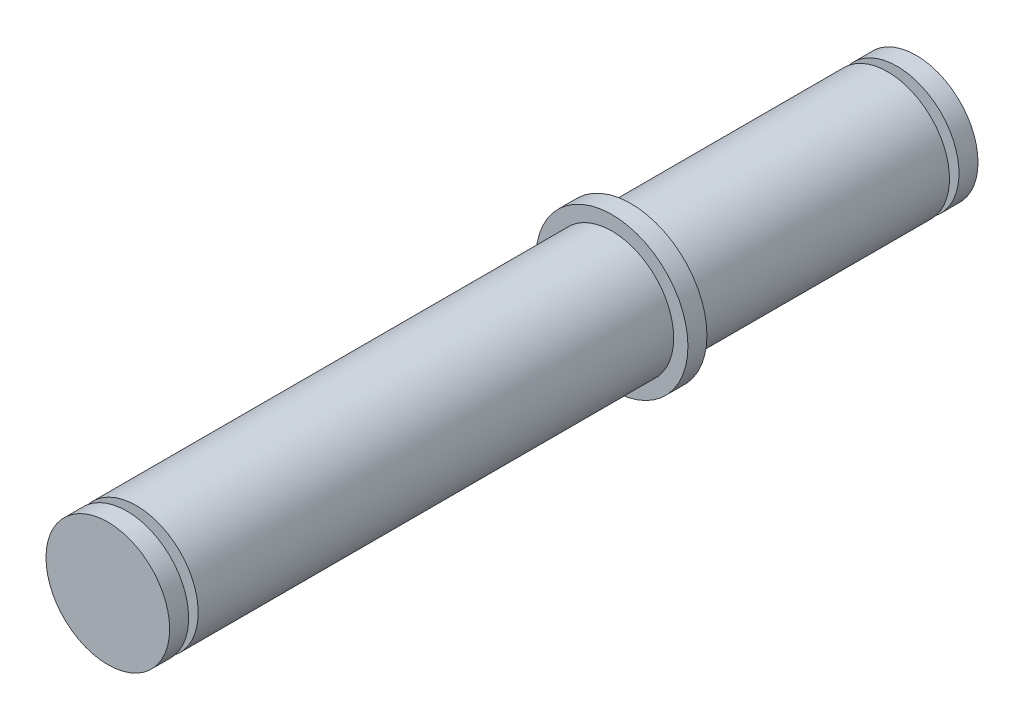
ISO-10303-21;
HEADER;
FILE_DESCRIPTION(('STEP AP214'),'2;1');
FILE_NAME('part.step','',(''),(''),'','','');
FILE_SCHEMA(('AUTOMOTIVE_DESIGN { 1 0 10303 214 1 1 1 1 }'));
ENDSEC;
DATA;
#1=APPLICATION_CONTEXT('core data for automotive mechanical design processes');
#2=APPLICATION_PROTOCOL_DEFINITION('international standard','automotive_design',2000,#1);
#3=PRODUCT_CONTEXT('',#1,'mechanical');
#4=PRODUCT('Part','Part','',(#3));
#5=PRODUCT_RELATED_PRODUCT_CATEGORY('part','',(#4));
#6=PRODUCT_DEFINITION_FORMATION('','',#4);
#7=PRODUCT_DEFINITION_CONTEXT('part definition',#1,'design');
#8=PRODUCT_DEFINITION('design','',#6,#7);
#9=PRODUCT_DEFINITION_SHAPE('','',#8);
#10=(LENGTH_UNIT() NAMED_UNIT(*) SI_UNIT(.MILLI.,.METRE.));
#11=(NAMED_UNIT(*) PLANE_ANGLE_UNIT() SI_UNIT($,.RADIAN.));
#12=(NAMED_UNIT(*) SI_UNIT($,.STERADIAN.) SOLID_ANGLE_UNIT());
#13=UNCERTAINTY_MEASURE_WITH_UNIT(LENGTH_MEASURE(1.E-05),#10,'distance_accuracy_value','');
#14=(GEOMETRIC_REPRESENTATION_CONTEXT(3) GLOBAL_UNCERTAINTY_ASSIGNED_CONTEXT((#13)) GLOBAL_UNIT_ASSIGNED_CONTEXT((#10,
#11,#12)) REPRESENTATION_CONTEXT('',''));
#15=CARTESIAN_POINT('',(0.,0.,0.));
#16=DIRECTION('',(0.,0.,1.));
#17=DIRECTION('',(1.,0.,0.));
#18=AXIS2_PLACEMENT_3D('',#15,#16,#17);
#19=CARTESIAN_POINT('',(0.,0.,42.5));
#20=DIRECTION('',(0.,0.,-1.));
#21=DIRECTION('',(-1.,0.,0.));
#22=AXIS2_PLACEMENT_3D('',#19,#20,#21);
#23=CYLINDRICAL_SURFACE('',#22,6.5);
#24=CARTESIAN_POINT('',(0.,0.,-10.5));
#25=DIRECTION('',(0.,0.,1.));
#26=DIRECTION('',(1.,0.,0.));
#27=AXIS2_PLACEMENT_3D('',#24,#25,#26);
#28=CIRCLE('',#27,6.5);
#29=CARTESIAN_POINT('',(6.5,0.,-10.5));
#30=VERTEX_POINT('',#29);
#31=EDGE_CURVE('E34',#30,#30,#28,.T.);
#32=ORIENTED_EDGE('',*,*,#31,.T.);
#33=EDGE_LOOP('',(#32));
#34=FACE_BOUND('',#33,.T.);
#35=CARTESIAN_POINT('',(0.,0.,39.5));
#36=DIRECTION('',(0.,0.,-1.));
#37=DIRECTION('',(-1.,0.,0.));
#38=AXIS2_PLACEMENT_3D('',#35,#36,#37);
#39=CIRCLE('',#38,6.5);
#40=CARTESIAN_POINT('',(-6.5,0.,39.5));
#41=VERTEX_POINT('',#40);
#42=EDGE_CURVE('E63',#41,#41,#39,.T.);
#43=ORIENTED_EDGE('',*,*,#42,.T.);
#44=EDGE_LOOP('',(#43));
#45=FACE_BOUND('',#44,.T.);
#46=ADVANCED_FACE('F30',(#34,#45),#23,.T.);
#47=CARTESIAN_POINT('',(0.,0.,-12.5));
#48=DIRECTION('',(0.,0.,1.));
#49=DIRECTION('',(1.,0.,0.));
#50=AXIS2_PLACEMENT_3D('',#47,#48,#49);
#51=CIRCLE('',#50,6.5);
#52=CARTESIAN_POINT('',(6.5,0.,-12.5));
#53=VERTEX_POINT('',#52);
#54=EDGE_CURVE('E10',#53,#53,#51,.T.);
#55=ORIENTED_EDGE('',*,*,#54,.F.);
#56=EDGE_LOOP('',(#55));
#57=FACE_BOUND('',#56,.T.);
#58=CARTESIAN_POINT('',(0.,0.,-39.5));
#59=DIRECTION('',(0.,0.,-1.));
#60=DIRECTION('',(-1.,0.,0.));
#61=AXIS2_PLACEMENT_3D('',#58,#59,#60);
#62=CIRCLE('',#61,6.5);
#63=CARTESIAN_POINT('',(-6.5,0.,-39.5));
#64=VERTEX_POINT('',#63);
#65=EDGE_CURVE('E51',#64,#64,#62,.T.);
#66=ORIENTED_EDGE('',*,*,#65,.F.);
#67=EDGE_LOOP('',(#66));
#68=FACE_BOUND('',#67,.T.);
#69=ADVANCED_FACE('F99',(#57,#68),#23,.T.);
#70=CARTESIAN_POINT('',(0.,0.,-10.5));
#71=DIRECTION('',(0.,0.,-1.));
#72=DIRECTION('',(-1.,0.,0.));
#73=AXIS2_PLACEMENT_3D('',#70,#71,#72);
#74=CYLINDRICAL_SURFACE('',#73,8.);
#75=CARTESIAN_POINT('',(0.,0.,-10.5));
#76=DIRECTION('',(0.,0.,1.));
#77=DIRECTION('',(1.,0.,0.));
#78=AXIS2_PLACEMENT_3D('',#75,#76,#77);
#79=CIRCLE('',#78,8.);
#80=CARTESIAN_POINT('',(8.,0.,-10.5));
#81=VERTEX_POINT('',#80);
#82=EDGE_CURVE('E50',#81,#81,#79,.T.);
#83=ORIENTED_EDGE('',*,*,#82,.F.);
#84=EDGE_LOOP('',(#83));
#85=FACE_BOUND('',#84,.T.);
#86=CARTESIAN_POINT('',(0.,0.,-12.5));
#87=DIRECTION('',(0.,0.,1.));
#88=DIRECTION('',(1.,0.,0.));
#89=AXIS2_PLACEMENT_3D('',#86,#87,#88);
#90=CIRCLE('',#89,8.);
#91=CARTESIAN_POINT('',(8.,0.,-12.5));
#92=VERTEX_POINT('',#91);
#93=EDGE_CURVE('E47',#92,#92,#90,.T.);
#94=ORIENTED_EDGE('',*,*,#93,.T.);
#95=EDGE_LOOP('',(#94));
#96=FACE_BOUND('',#95,.T.);
#97=ADVANCED_FACE('F104',(#85,#96),#74,.T.);
#98=CARTESIAN_POINT('',(0.,0.,-10.5));
#99=DIRECTION('',(0.,0.,1.));
#100=DIRECTION('',(1.,0.,0.));
#101=AXIS2_PLACEMENT_3D('',#98,#99,#100);
#102=PLANE('',#101);
#103=ORIENTED_EDGE('',*,*,#31,.F.);
#104=EDGE_LOOP('',(#103));
#105=FACE_BOUND('',#104,.T.);
#106=ORIENTED_EDGE('',*,*,#82,.T.);
#107=EDGE_LOOP('',(#106));
#108=FACE_BOUND('',#107,.T.);
#109=ADVANCED_FACE('F143',(#105,#108),#102,.T.);
#110=CARTESIAN_POINT('',(0.,0.,-12.5));
#111=DIRECTION('',(0.,0.,1.));
#112=DIRECTION('',(1.,0.,0.));
#113=AXIS2_PLACEMENT_3D('',#110,#111,#112);
#114=PLANE('',#113);
#115=ORIENTED_EDGE('',*,*,#54,.T.);
#116=EDGE_LOOP('',(#115));
#117=FACE_BOUND('',#116,.T.);
#118=ORIENTED_EDGE('',*,*,#93,.F.);
#119=EDGE_LOOP('',(#118));
#120=FACE_BOUND('',#119,.T.);
#121=ADVANCED_FACE('F139',(#117,#120),#114,.F.);
#122=CARTESIAN_POINT('',(0.,0.,-39.5));
#123=DIRECTION('',(0.,0.,-1.));
#124=DIRECTION('',(-1.,0.,0.));
#125=AXIS2_PLACEMENT_3D('',#122,#123,#124);
#126=PLANE('',#125);
#127=CARTESIAN_POINT('',(0.,0.,-39.5));
#128=DIRECTION('',(0.,0.,-1.));
#129=DIRECTION('',(-1.,0.,0.));
#130=AXIS2_PLACEMENT_3D('',#127,#128,#129);
#131=CIRCLE('',#130,4.5);
#132=CARTESIAN_POINT('',(-4.5,0.,-39.5));
#133=VERTEX_POINT('',#132);
#134=EDGE_CURVE('E57',#133,#133,#131,.T.);
#135=ORIENTED_EDGE('',*,*,#134,.F.);
#136=EDGE_LOOP('',(#135));
#137=FACE_BOUND('',#136,.T.);
#138=ORIENTED_EDGE('',*,*,#65,.T.);
#139=EDGE_LOOP('',(#138));
#140=FACE_BOUND('',#139,.T.);
#141=ADVANCED_FACE('F131',(#137,#140),#126,.T.);
#142=CARTESIAN_POINT('',(0.,0.,-40.5));
#143=DIRECTION('',(0.,0.,-1.));
#144=DIRECTION('',(-1.,0.,0.));
#145=AXIS2_PLACEMENT_3D('',#142,#143,#144);
#146=PLANE('',#145);
#147=CARTESIAN_POINT('',(0.,0.,-40.5));
#148=DIRECTION('',(0.,0.,-1.));
#149=DIRECTION('',(-1.,0.,0.));
#150=AXIS2_PLACEMENT_3D('',#147,#148,#149);
#151=CIRCLE('',#150,4.5);
#152=CARTESIAN_POINT('',(-4.5,0.,-40.5));
#153=VERTEX_POINT('',#152);
#154=EDGE_CURVE('E60',#153,#153,#151,.T.);
#155=ORIENTED_EDGE('',*,*,#154,.T.);
#156=EDGE_LOOP('',(#155));
#157=FACE_BOUND('',#156,.T.);
#158=CARTESIAN_POINT('',(0.,0.,-40.5));
#159=DIRECTION('',(0.,0.,-1.));
#160=DIRECTION('',(-1.,0.,0.));
#161=AXIS2_PLACEMENT_3D('',#158,#159,#160);
#162=CIRCLE('',#161,6.5);
#163=CARTESIAN_POINT('',(-6.5,0.,-40.5));
#164=VERTEX_POINT('',#163);
#165=EDGE_CURVE('E54',#164,#164,#162,.T.);
#166=ORIENTED_EDGE('',*,*,#165,.F.);
#167=EDGE_LOOP('',(#166));
#168=FACE_BOUND('',#167,.T.);
#169=ADVANCED_FACE('F129',(#157,#168),#146,.F.);
#170=CARTESIAN_POINT('',(0.,0.,-39.5));
#171=DIRECTION('',(0.,0.,-1.));
#172=DIRECTION('',(-1.,0.,0.));
#173=AXIS2_PLACEMENT_3D('',#170,#171,#172);
#174=CYLINDRICAL_SURFACE('',#173,4.5);
#175=ORIENTED_EDGE('',*,*,#134,.T.);
#176=EDGE_LOOP('',(#175));
#177=FACE_BOUND('',#176,.T.);
#178=ORIENTED_EDGE('',*,*,#154,.F.);
#179=EDGE_LOOP('',(#178));
#180=FACE_BOUND('',#179,.T.);
#181=ADVANCED_FACE('F123',(#177,#180),#174,.T.);
#182=CARTESIAN_POINT('',(0.,0.,-42.5));
#183=DIRECTION('',(0.,0.,1.));
#184=DIRECTION('',(1.,0.,0.));
#185=AXIS2_PLACEMENT_3D('',#182,#183,#184);
#186=PLANE('',#185);
#187=CARTESIAN_POINT('',(0.,0.,-42.5));
#188=DIRECTION('',(0.,0.,1.));
#189=DIRECTION('',(1.,0.,0.));
#190=AXIS2_PLACEMENT_3D('',#187,#188,#189);
#191=CIRCLE('',#190,6.5);
#192=CARTESIAN_POINT('',(6.5,0.,-42.5));
#193=VERTEX_POINT('',#192);
#194=EDGE_CURVE('E42',#193,#193,#191,.T.);
#195=ORIENTED_EDGE('',*,*,#194,.F.);
#196=EDGE_LOOP('',(#195));
#197=FACE_BOUND('',#196,.T.);
#198=ADVANCED_FACE('F118',(#197),#186,.F.);
#199=ORIENTED_EDGE('',*,*,#165,.T.);
#200=EDGE_LOOP('',(#199));
#201=FACE_BOUND('',#200,.T.);
#202=ORIENTED_EDGE('',*,*,#194,.T.);
#203=EDGE_LOOP('',(#202));
#204=FACE_BOUND('',#203,.T.);
#205=ADVANCED_FACE('F94',(#201,#204),#23,.T.);
#206=CARTESIAN_POINT('',(0.,0.,39.5));
#207=DIRECTION('',(0.,0.,1.));
#208=DIRECTION('',(-1.,0.,0.));
#209=AXIS2_PLACEMENT_3D('',#206,#207,#208);
#210=PLANE('',#209);
#211=ORIENTED_EDGE('',*,*,#42,.F.);
#212=EDGE_LOOP('',(#211));
#213=FACE_BOUND('',#212,.T.);
#214=CARTESIAN_POINT('',(0.,0.,39.5));
#215=DIRECTION('',(0.,0.,-1.));
#216=DIRECTION('',(-1.,0.,0.));
#217=AXIS2_PLACEMENT_3D('',#214,#215,#216);
#218=CIRCLE('',#217,4.5);
#219=CARTESIAN_POINT('',(-4.5,0.,39.5));
#220=VERTEX_POINT('',#219);
#221=EDGE_CURVE('E69',#220,#220,#218,.T.);
#222=ORIENTED_EDGE('',*,*,#221,.T.);
#223=EDGE_LOOP('',(#222));
#224=FACE_BOUND('',#223,.T.);
#225=ADVANCED_FACE('F78',(#213,#224),#210,.T.);
#226=CARTESIAN_POINT('',(0.,0.,40.5));
#227=DIRECTION('',(0.,0.,1.));
#228=DIRECTION('',(-1.,0.,0.));
#229=AXIS2_PLACEMENT_3D('',#226,#227,#228);
#230=PLANE('',#229);
#231=CARTESIAN_POINT('',(0.,0.,40.5));
#232=DIRECTION('',(0.,0.,-1.));
#233=DIRECTION('',(-1.,0.,0.));
#234=AXIS2_PLACEMENT_3D('',#231,#232,#233);
#235=CIRCLE('',#234,6.5);
#236=CARTESIAN_POINT('',(-6.5,0.,40.5));
#237=VERTEX_POINT('',#236);
#238=EDGE_CURVE('E66',#237,#237,#235,.T.);
#239=ORIENTED_EDGE('',*,*,#238,.T.);
#240=EDGE_LOOP('',(#239));
#241=FACE_BOUND('',#240,.T.);
#242=CARTESIAN_POINT('',(0.,0.,40.5));
#243=DIRECTION('',(0.,0.,-1.));
#244=DIRECTION('',(-1.,0.,0.));
#245=AXIS2_PLACEMENT_3D('',#242,#243,#244);
#246=CIRCLE('',#245,4.5);
#247=CARTESIAN_POINT('',(-4.5,0.,40.5));
#248=VERTEX_POINT('',#247);
#249=EDGE_CURVE('E72',#248,#248,#246,.T.);
#250=ORIENTED_EDGE('',*,*,#249,.F.);
#251=EDGE_LOOP('',(#250));
#252=FACE_BOUND('',#251,.T.);
#253=ADVANCED_FACE('F84',(#241,#252),#230,.F.);
#254=CARTESIAN_POINT('',(0.,0.,39.5));
#255=DIRECTION('',(0.,0.,1.));
#256=DIRECTION('',(1.,0.,0.));
#257=AXIS2_PLACEMENT_3D('',#254,#255,#256);
#258=CYLINDRICAL_SURFACE('',#257,4.5);
#259=ORIENTED_EDGE('',*,*,#221,.F.);
#260=EDGE_LOOP('',(#259));
#261=FACE_BOUND('',#260,.T.);
#262=ORIENTED_EDGE('',*,*,#249,.T.);
#263=EDGE_LOOP('',(#262));
#264=FACE_BOUND('',#263,.T.);
#265=ADVANCED_FACE('F80',(#261,#264),#258,.T.);
#266=CARTESIAN_POINT('',(0.,0.,42.5));
#267=DIRECTION('',(0.,0.,1.));
#268=DIRECTION('',(1.,0.,0.));
#269=AXIS2_PLACEMENT_3D('',#266,#267,#268);
#270=PLANE('',#269);
#271=CARTESIAN_POINT('',(0.,0.,42.5));
#272=DIRECTION('',(0.,0.,1.));
#273=DIRECTION('',(1.,0.,0.));
#274=AXIS2_PLACEMENT_3D('',#271,#272,#273);
#275=CIRCLE('',#274,6.5);
#276=CARTESIAN_POINT('',(6.5,0.,42.5));
#277=VERTEX_POINT('',#276);
#278=EDGE_CURVE('E38',#277,#277,#275,.T.);
#279=ORIENTED_EDGE('',*,*,#278,.T.);
#280=EDGE_LOOP('',(#279));
#281=FACE_BOUND('',#280,.T.);
#282=ADVANCED_FACE('F83',(#281),#270,.T.);
#283=ORIENTED_EDGE('',*,*,#238,.F.);
#284=EDGE_LOOP('',(#283));
#285=FACE_BOUND('',#284,.T.);
#286=ORIENTED_EDGE('',*,*,#278,.F.);
#287=EDGE_LOOP('',(#286));
#288=FACE_BOUND('',#287,.T.);
#289=ADVANCED_FACE('F32',(#285,#288),#23,.T.);
#290=CLOSED_SHELL('',(#46,#69,#97,#109,#121,#141,#169,#181,#198,#205,#225,#253,#265,#282,#289));
#291=MANIFOLD_SOLID_BREP('B2',#290);
#292=ADVANCED_BREP_SHAPE_REPRESENTATION('',(#18,#291),#14);
#293=SHAPE_DEFINITION_REPRESENTATION(#9,#292);
ENDSEC;
END-ISO-10303-21;
